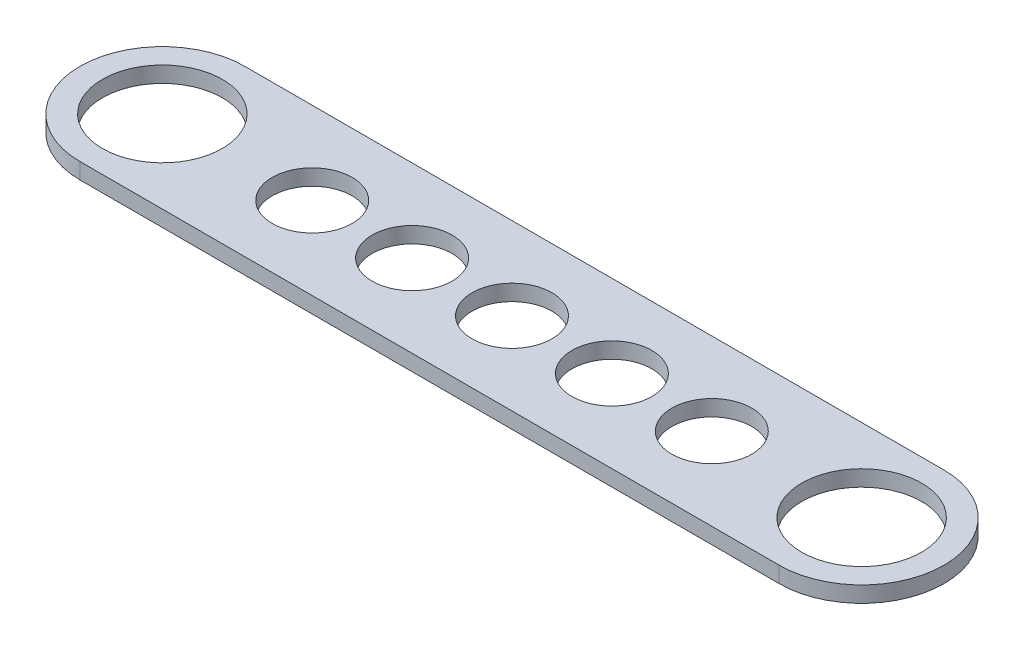
ISO-10303-21;
HEADER;
FILE_DESCRIPTION(('STEP AP214'),'2;1');
FILE_NAME('part.step','',(''),(''),'','','');
FILE_SCHEMA(('AUTOMOTIVE_DESIGN { 1 0 10303 214 1 1 1 1 }'));
ENDSEC;
DATA;
#1=APPLICATION_CONTEXT('core data for automotive mechanical design processes');
#2=APPLICATION_PROTOCOL_DEFINITION('international standard','automotive_design',2000,#1);
#3=PRODUCT_CONTEXT('',#1,'mechanical');
#4=PRODUCT('Part','Part','',(#3));
#5=PRODUCT_RELATED_PRODUCT_CATEGORY('part','',(#4));
#6=PRODUCT_DEFINITION_FORMATION('','',#4);
#7=PRODUCT_DEFINITION_CONTEXT('part definition',#1,'design');
#8=PRODUCT_DEFINITION('design','',#6,#7);
#9=PRODUCT_DEFINITION_SHAPE('','',#8);
#10=(LENGTH_UNIT() NAMED_UNIT(*) SI_UNIT(.MILLI.,.METRE.));
#11=(NAMED_UNIT(*) PLANE_ANGLE_UNIT() SI_UNIT($,.RADIAN.));
#12=(NAMED_UNIT(*) SI_UNIT($,.STERADIAN.) SOLID_ANGLE_UNIT());
#13=UNCERTAINTY_MEASURE_WITH_UNIT(LENGTH_MEASURE(1.E-05),#10,'distance_accuracy_value','');
#14=(GEOMETRIC_REPRESENTATION_CONTEXT(3) GLOBAL_UNCERTAINTY_ASSIGNED_CONTEXT((#13)) GLOBAL_UNIT_ASSIGNED_CONTEXT((#10,
#11,#12)) REPRESENTATION_CONTEXT('',''));
#15=CARTESIAN_POINT('',(0.,0.,0.));
#16=DIRECTION('',(0.,0.,1.));
#17=DIRECTION('',(1.,0.,0.));
#18=AXIS2_PLACEMENT_3D('',#15,#16,#17);
#19=CARTESIAN_POINT('',(0.,4.064,0.));
#20=DIRECTION('',(0.,1.,0.));
#21=DIRECTION('',(0.,0.,1.));
#22=AXIS2_PLACEMENT_3D('',#19,#20,#21);
#23=PLANE('',#22);
#24=CARTESIAN_POINT('',(63.5,4.064,0.));
#25=DIRECTION('',(0.,1.,0.));
#26=DIRECTION('',(0.,0.,1.));
#27=AXIS2_PLACEMENT_3D('',#24,#25,#26);
#28=CIRCLE('',#27,10.16);
#29=CARTESIAN_POINT('',(63.5,4.064,10.16));
#30=VERTEX_POINT('',#29);
#31=EDGE_CURVE('E276',#30,#30,#28,.T.);
#32=ORIENTED_EDGE('',*,*,#31,.F.);
#33=EDGE_LOOP('',(#32));
#34=FACE_BOUND('',#33,.T.);
#35=CARTESIAN_POINT('',(38.1,4.064,0.));
#36=DIRECTION('',(0.,1.,0.));
#37=DIRECTION('',(0.,0.,1.));
#38=AXIS2_PLACEMENT_3D('',#35,#36,#37);
#39=CIRCLE('',#38,10.16);
#40=CARTESIAN_POINT('',(38.1,4.064,10.16));
#41=VERTEX_POINT('',#40);
#42=EDGE_CURVE('E273',#41,#41,#39,.T.);
#43=ORIENTED_EDGE('',*,*,#42,.F.);
#44=EDGE_LOOP('',(#43));
#45=FACE_BOUND('',#44,.T.);
#46=CARTESIAN_POINT('',(0.,4.064,0.));
#47=DIRECTION('',(0.,1.,0.));
#48=DIRECTION('',(0.,0.,1.));
#49=AXIS2_PLACEMENT_3D('',#46,#47,#48);
#50=CIRCLE('',#49,15.24);
#51=CARTESIAN_POINT('',(0.,4.064,15.24));
#52=VERTEX_POINT('',#51);
#53=EDGE_CURVE('E104',#52,#52,#50,.T.);
#54=ORIENTED_EDGE('',*,*,#53,.F.);
#55=EDGE_LOOP('',(#54));
#56=FACE_BOUND('',#55,.T.);
#57=CARTESIAN_POINT('',(0.,4.064,0.));
#58=DIRECTION('',(0.,1.,0.));
#59=DIRECTION('',(0.,0.,1.));
#60=AXIS2_PLACEMENT_3D('',#57,#58,#59);
#61=CIRCLE('',#60,20.955);
#62=CARTESIAN_POINT('',(0.,4.064,-20.955));
#63=VERTEX_POINT('',#62);
#64=CARTESIAN_POINT('',(0.,4.064,20.955));
#65=VERTEX_POINT('',#64);
#66=EDGE_CURVE('E86',#63,#65,#61,.T.);
#67=ORIENTED_EDGE('',*,*,#66,.T.);
#68=DIRECTION('',(1.,0.,0.));
#69=VECTOR('',#68,1.);
#70=CARTESIAN_POINT('',(0.,4.064,20.955));
#71=LINE('',#70,#69);
#72=CARTESIAN_POINT('',(177.8,4.064,20.955));
#73=VERTEX_POINT('',#72);
#74=EDGE_CURVE('E81',#65,#73,#71,.T.);
#75=ORIENTED_EDGE('',*,*,#74,.T.);
#76=CARTESIAN_POINT('',(177.8,4.064,0.));
#77=DIRECTION('',(0.,1.,0.));
#78=DIRECTION('',(0.,0.,1.));
#79=AXIS2_PLACEMENT_3D('',#76,#77,#78);
#80=CIRCLE('',#79,20.955);
#81=CARTESIAN_POINT('',(177.8,4.064,-20.955));
#82=VERTEX_POINT('',#81);
#83=EDGE_CURVE('E84',#73,#82,#80,.T.);
#84=ORIENTED_EDGE('',*,*,#83,.T.);
#85=DIRECTION('',(-1.,0.,0.));
#86=VECTOR('',#85,1.);
#87=CARTESIAN_POINT('',(0.,4.064,-20.955));
#88=LINE('',#87,#86);
#89=EDGE_CURVE('E50',#82,#63,#88,.T.);
#90=ORIENTED_EDGE('',*,*,#89,.T.);
#91=EDGE_LOOP('',(#67,#75,#84,#90));
#92=FACE_BOUND('',#91,.T.);
#93=CARTESIAN_POINT('',(177.8,4.064,0.));
#94=DIRECTION('',(0.,1.,0.));
#95=DIRECTION('',(0.,0.,1.));
#96=AXIS2_PLACEMENT_3D('',#93,#94,#95);
#97=CIRCLE('',#96,15.24);
#98=CARTESIAN_POINT('',(177.8,4.064,15.24));
#99=VERTEX_POINT('',#98);
#100=EDGE_CURVE('E263',#99,#99,#97,.T.);
#101=ORIENTED_EDGE('',*,*,#100,.F.);
#102=EDGE_LOOP('',(#101));
#103=FACE_BOUND('',#102,.T.);
#104=CARTESIAN_POINT('',(88.9,4.064,0.));
#105=DIRECTION('',(0.,1.,0.));
#106=DIRECTION('',(0.,0.,1.));
#107=AXIS2_PLACEMENT_3D('',#104,#105,#106);
#108=CIRCLE('',#107,10.16);
#109=CARTESIAN_POINT('',(88.9,4.064,10.16));
#110=VERTEX_POINT('',#109);
#111=EDGE_CURVE('E114',#110,#110,#108,.T.);
#112=ORIENTED_EDGE('',*,*,#111,.F.);
#113=EDGE_LOOP('',(#112));
#114=FACE_BOUND('',#113,.T.);
#115=CARTESIAN_POINT('',(114.3,4.064,0.));
#116=DIRECTION('',(0.,1.,0.));
#117=DIRECTION('',(0.,0.,1.));
#118=AXIS2_PLACEMENT_3D('',#115,#116,#117);
#119=CIRCLE('',#118,10.16);
#120=CARTESIAN_POINT('',(114.3,4.064,10.16));
#121=VERTEX_POINT('',#120);
#122=EDGE_CURVE('E120',#121,#121,#119,.T.);
#123=ORIENTED_EDGE('',*,*,#122,.F.);
#124=EDGE_LOOP('',(#123));
#125=FACE_BOUND('',#124,.T.);
#126=CARTESIAN_POINT('',(139.7,4.064,0.));
#127=DIRECTION('',(0.,1.,0.));
#128=DIRECTION('',(0.,0.,1.));
#129=AXIS2_PLACEMENT_3D('',#126,#127,#128);
#130=CIRCLE('',#129,10.16);
#131=CARTESIAN_POINT('',(139.7,4.064,10.16));
#132=VERTEX_POINT('',#131);
#133=EDGE_CURVE('E11',#132,#132,#130,.T.);
#134=ORIENTED_EDGE('',*,*,#133,.F.);
#135=EDGE_LOOP('',(#134));
#136=FACE_BOUND('',#135,.T.);
#137=ADVANCED_FACE('F33',(#34,#45,#56,#92,#103,#114,#125,#136),#23,.T.);
#138=CARTESIAN_POINT('',(0.,0.,0.));
#139=DIRECTION('',(0.,1.,0.));
#140=DIRECTION('',(0.,0.,1.));
#141=AXIS2_PLACEMENT_3D('',#138,#139,#140);
#142=PLANE('',#141);
#143=CARTESIAN_POINT('',(63.5,0.,0.));
#144=DIRECTION('',(0.,1.,0.));
#145=DIRECTION('',(0.,0.,1.));
#146=AXIS2_PLACEMENT_3D('',#143,#144,#145);
#147=CIRCLE('',#146,10.16);
#148=CARTESIAN_POINT('',(63.5,0.,10.16));
#149=VERTEX_POINT('',#148);
#150=EDGE_CURVE('E281',#149,#149,#147,.T.);
#151=ORIENTED_EDGE('',*,*,#150,.T.);
#152=EDGE_LOOP('',(#151));
#153=FACE_BOUND('',#152,.T.);
#154=CARTESIAN_POINT('',(38.1,0.,0.));
#155=DIRECTION('',(0.,1.,0.));
#156=DIRECTION('',(0.,0.,1.));
#157=AXIS2_PLACEMENT_3D('',#154,#155,#156);
#158=CIRCLE('',#157,10.16);
#159=CARTESIAN_POINT('',(38.1,0.,10.16));
#160=VERTEX_POINT('',#159);
#161=EDGE_CURVE('E271',#160,#160,#158,.T.);
#162=ORIENTED_EDGE('',*,*,#161,.T.);
#163=EDGE_LOOP('',(#162));
#164=FACE_BOUND('',#163,.T.);
#165=CARTESIAN_POINT('',(0.,0.,0.));
#166=DIRECTION('',(0.,1.,0.));
#167=DIRECTION('',(0.,0.,1.));
#168=AXIS2_PLACEMENT_3D('',#165,#166,#167);
#169=CIRCLE('',#168,20.955);
#170=CARTESIAN_POINT('',(0.,0.,-20.955));
#171=VERTEX_POINT('',#170);
#172=CARTESIAN_POINT('',(0.,0.,20.955));
#173=VERTEX_POINT('',#172);
#174=EDGE_CURVE('E101',#171,#173,#169,.T.);
#175=ORIENTED_EDGE('',*,*,#174,.F.);
#176=DIRECTION('',(-1.,0.,0.));
#177=VECTOR('',#176,1.);
#178=CARTESIAN_POINT('',(0.,0.,-20.955));
#179=LINE('',#178,#177);
#180=CARTESIAN_POINT('',(177.8,0.,-20.955));
#181=VERTEX_POINT('',#180);
#182=EDGE_CURVE('E73',#181,#171,#179,.T.);
#183=ORIENTED_EDGE('',*,*,#182,.F.);
#184=CARTESIAN_POINT('',(177.8,0.,0.));
#185=DIRECTION('',(0.,1.,0.));
#186=DIRECTION('',(0.,0.,1.));
#187=AXIS2_PLACEMENT_3D('',#184,#185,#186);
#188=CIRCLE('',#187,20.955);
#189=CARTESIAN_POINT('',(177.8,0.,20.955));
#190=VERTEX_POINT('',#189);
#191=EDGE_CURVE('E67',#190,#181,#188,.T.);
#192=ORIENTED_EDGE('',*,*,#191,.F.);
#193=DIRECTION('',(1.,0.,0.));
#194=VECTOR('',#193,1.);
#195=CARTESIAN_POINT('',(0.,0.,20.955));
#196=LINE('',#195,#194);
#197=EDGE_CURVE('E91',#173,#190,#196,.T.);
#198=ORIENTED_EDGE('',*,*,#197,.F.);
#199=EDGE_LOOP('',(#175,#183,#192,#198));
#200=FACE_BOUND('',#199,.T.);
#201=CARTESIAN_POINT('',(0.,0.,0.));
#202=DIRECTION('',(0.,1.,0.));
#203=DIRECTION('',(0.,0.,1.));
#204=AXIS2_PLACEMENT_3D('',#201,#202,#203);
#205=CIRCLE('',#204,15.24);
#206=CARTESIAN_POINT('',(0.,0.,15.24));
#207=VERTEX_POINT('',#206);
#208=EDGE_CURVE('E261',#207,#207,#205,.T.);
#209=ORIENTED_EDGE('',*,*,#208,.T.);
#210=EDGE_LOOP('',(#209));
#211=FACE_BOUND('',#210,.T.);
#212=CARTESIAN_POINT('',(177.8,0.,0.));
#213=DIRECTION('',(0.,1.,0.));
#214=DIRECTION('',(0.,0.,1.));
#215=AXIS2_PLACEMENT_3D('',#212,#213,#214);
#216=CIRCLE('',#215,15.24);
#217=CARTESIAN_POINT('',(177.8,0.,15.24));
#218=VERTEX_POINT('',#217);
#219=EDGE_CURVE('E267',#218,#218,#216,.T.);
#220=ORIENTED_EDGE('',*,*,#219,.T.);
#221=EDGE_LOOP('',(#220));
#222=FACE_BOUND('',#221,.T.);
#223=CARTESIAN_POINT('',(88.9,0.,0.));
#224=DIRECTION('',(0.,1.,0.));
#225=DIRECTION('',(0.,0.,1.));
#226=AXIS2_PLACEMENT_3D('',#223,#224,#225);
#227=CIRCLE('',#226,10.16);
#228=CARTESIAN_POINT('',(88.9,0.,10.16));
#229=VERTEX_POINT('',#228);
#230=EDGE_CURVE('E111',#229,#229,#227,.T.);
#231=ORIENTED_EDGE('',*,*,#230,.T.);
#232=EDGE_LOOP('',(#231));
#233=FACE_BOUND('',#232,.T.);
#234=CARTESIAN_POINT('',(114.3,0.,0.));
#235=DIRECTION('',(0.,1.,0.));
#236=DIRECTION('',(0.,0.,1.));
#237=AXIS2_PLACEMENT_3D('',#234,#235,#236);
#238=CIRCLE('',#237,10.16);
#239=CARTESIAN_POINT('',(114.3,0.,10.16));
#240=VERTEX_POINT('',#239);
#241=EDGE_CURVE('E117',#240,#240,#238,.T.);
#242=ORIENTED_EDGE('',*,*,#241,.T.);
#243=EDGE_LOOP('',(#242));
#244=FACE_BOUND('',#243,.T.);
#245=CARTESIAN_POINT('',(139.7,0.,0.));
#246=DIRECTION('',(0.,1.,0.));
#247=DIRECTION('',(0.,0.,1.));
#248=AXIS2_PLACEMENT_3D('',#245,#246,#247);
#249=CIRCLE('',#248,10.16);
#250=CARTESIAN_POINT('',(139.7,0.,10.16));
#251=VERTEX_POINT('',#250);
#252=EDGE_CURVE('E42',#251,#251,#249,.T.);
#253=ORIENTED_EDGE('',*,*,#252,.T.);
#254=EDGE_LOOP('',(#253));
#255=FACE_BOUND('',#254,.T.);
#256=ADVANCED_FACE('F125',(#153,#164,#200,#211,#222,#233,#244,#255),#142,.F.);
#257=CARTESIAN_POINT('',(0.,4.064,0.));
#258=DIRECTION('',(0.,-1.,0.));
#259=DIRECTION('',(0.,0.,-1.));
#260=AXIS2_PLACEMENT_3D('',#257,#258,#259);
#261=CYLINDRICAL_SURFACE('',#260,20.955);
#262=ORIENTED_EDGE('',*,*,#174,.T.);
#263=DIRECTION('',(0.,-1.,0.));
#264=VECTOR('',#263,1.);
#265=CARTESIAN_POINT('',(0.,4.064,20.955));
#266=LINE('',#265,#264);
#267=EDGE_CURVE('E92',#65,#173,#266,.T.);
#268=ORIENTED_EDGE('',*,*,#267,.F.);
#269=ORIENTED_EDGE('',*,*,#66,.F.);
#270=DIRECTION('',(0.,-1.,0.));
#271=VECTOR('',#270,1.);
#272=CARTESIAN_POINT('',(0.,4.064,-20.955));
#273=LINE('',#272,#271);
#274=EDGE_CURVE('E97',#63,#171,#273,.T.);
#275=ORIENTED_EDGE('',*,*,#274,.T.);
#276=EDGE_LOOP('',(#262,#268,#269,#275));
#277=FACE_BOUND('',#276,.T.);
#278=ADVANCED_FACE('F138',(#277),#261,.T.);
#279=CARTESIAN_POINT('',(0.,4.064,20.955));
#280=DIRECTION('',(0.,0.,-1.));
#281=DIRECTION('',(-1.,0.,0.));
#282=AXIS2_PLACEMENT_3D('',#279,#280,#281);
#283=PLANE('',#282);
#284=ORIENTED_EDGE('',*,*,#197,.T.);
#285=DIRECTION('',(0.,-1.,0.));
#286=VECTOR('',#285,1.);
#287=CARTESIAN_POINT('',(177.8,4.064,20.955));
#288=LINE('',#287,#286);
#289=EDGE_CURVE('E89',#73,#190,#288,.T.);
#290=ORIENTED_EDGE('',*,*,#289,.F.);
#291=ORIENTED_EDGE('',*,*,#74,.F.);
#292=ORIENTED_EDGE('',*,*,#267,.T.);
#293=EDGE_LOOP('',(#284,#290,#291,#292));
#294=FACE_BOUND('',#293,.T.);
#295=ADVANCED_FACE('F90',(#294),#283,.F.);
#296=CARTESIAN_POINT('',(177.8,4.064,0.));
#297=DIRECTION('',(0.,-1.,0.));
#298=DIRECTION('',(0.,0.,-1.));
#299=AXIS2_PLACEMENT_3D('',#296,#297,#298);
#300=CYLINDRICAL_SURFACE('',#299,20.955);
#301=ORIENTED_EDGE('',*,*,#191,.T.);
#302=DIRECTION('',(0.,-1.,0.));
#303=VECTOR('',#302,1.);
#304=CARTESIAN_POINT('',(177.8,4.064,-20.955));
#305=LINE('',#304,#303);
#306=EDGE_CURVE('E93',#82,#181,#305,.T.);
#307=ORIENTED_EDGE('',*,*,#306,.F.);
#308=ORIENTED_EDGE('',*,*,#83,.F.);
#309=ORIENTED_EDGE('',*,*,#289,.T.);
#310=EDGE_LOOP('',(#301,#307,#308,#309));
#311=FACE_BOUND('',#310,.T.);
#312=ADVANCED_FACE('F95',(#311),#300,.T.);
#313=CARTESIAN_POINT('',(0.,4.064,-20.955));
#314=DIRECTION('',(0.,0.,1.));
#315=DIRECTION('',(1.,0.,0.));
#316=AXIS2_PLACEMENT_3D('',#313,#314,#315);
#317=PLANE('',#316);
#318=ORIENTED_EDGE('',*,*,#182,.T.);
#319=ORIENTED_EDGE('',*,*,#274,.F.);
#320=ORIENTED_EDGE('',*,*,#89,.F.);
#321=ORIENTED_EDGE('',*,*,#306,.T.);
#322=EDGE_LOOP('',(#318,#319,#320,#321));
#323=FACE_BOUND('',#322,.T.);
#324=ADVANCED_FACE('F147',(#323),#317,.F.);
#325=CARTESIAN_POINT('',(0.,4.064,0.));
#326=DIRECTION('',(0.,-1.,0.));
#327=DIRECTION('',(0.,0.,-1.));
#328=AXIS2_PLACEMENT_3D('',#325,#326,#327);
#329=CYLINDRICAL_SURFACE('',#328,15.24);
#330=ORIENTED_EDGE('',*,*,#53,.T.);
#331=EDGE_LOOP('',(#330));
#332=FACE_BOUND('',#331,.T.);
#333=ORIENTED_EDGE('',*,*,#208,.F.);
#334=EDGE_LOOP('',(#333));
#335=FACE_BOUND('',#334,.T.);
#336=ADVANCED_FACE('F144',(#332,#335),#329,.F.);
#337=CARTESIAN_POINT('',(177.8,4.064,0.));
#338=DIRECTION('',(0.,-1.,0.));
#339=DIRECTION('',(0.,0.,-1.));
#340=AXIS2_PLACEMENT_3D('',#337,#338,#339);
#341=CYLINDRICAL_SURFACE('',#340,15.24);
#342=ORIENTED_EDGE('',*,*,#100,.T.);
#343=EDGE_LOOP('',(#342));
#344=FACE_BOUND('',#343,.T.);
#345=ORIENTED_EDGE('',*,*,#219,.F.);
#346=EDGE_LOOP('',(#345));
#347=FACE_BOUND('',#346,.T.);
#348=ADVANCED_FACE('F202',(#344,#347),#341,.F.);
#349=CARTESIAN_POINT('',(38.1,0.,0.));
#350=DIRECTION('',(0.,1.,0.));
#351=DIRECTION('',(0.,0.,1.));
#352=AXIS2_PLACEMENT_3D('',#349,#350,#351);
#353=CYLINDRICAL_SURFACE('',#352,10.16);
#354=ORIENTED_EDGE('',*,*,#161,.F.);
#355=EDGE_LOOP('',(#354));
#356=FACE_BOUND('',#355,.T.);
#357=ORIENTED_EDGE('',*,*,#42,.T.);
#358=EDGE_LOOP('',(#357));
#359=FACE_BOUND('',#358,.T.);
#360=ADVANCED_FACE('F192',(#356,#359),#353,.F.);
#361=CARTESIAN_POINT('',(63.5,0.,0.));
#362=DIRECTION('',(0.,1.,0.));
#363=DIRECTION('',(0.,0.,1.));
#364=AXIS2_PLACEMENT_3D('',#361,#362,#363);
#365=CYLINDRICAL_SURFACE('',#364,10.16);
#366=ORIENTED_EDGE('',*,*,#150,.F.);
#367=EDGE_LOOP('',(#366));
#368=FACE_BOUND('',#367,.T.);
#369=ORIENTED_EDGE('',*,*,#31,.T.);
#370=EDGE_LOOP('',(#369));
#371=FACE_BOUND('',#370,.T.);
#372=ADVANCED_FACE('F159',(#368,#371),#365,.F.);
#373=CARTESIAN_POINT('',(88.9,0.,0.));
#374=DIRECTION('',(0.,1.,0.));
#375=DIRECTION('',(0.,0.,1.));
#376=AXIS2_PLACEMENT_3D('',#373,#374,#375);
#377=CYLINDRICAL_SURFACE('',#376,10.16);
#378=ORIENTED_EDGE('',*,*,#230,.F.);
#379=EDGE_LOOP('',(#378));
#380=FACE_BOUND('',#379,.T.);
#381=ORIENTED_EDGE('',*,*,#111,.T.);
#382=EDGE_LOOP('',(#381));
#383=FACE_BOUND('',#382,.T.);
#384=ADVANCED_FACE('F157',(#380,#383),#377,.F.);
#385=CARTESIAN_POINT('',(114.3,0.,0.));
#386=DIRECTION('',(0.,1.,0.));
#387=DIRECTION('',(0.,0.,1.));
#388=AXIS2_PLACEMENT_3D('',#385,#386,#387);
#389=CYLINDRICAL_SURFACE('',#388,10.16);
#390=ORIENTED_EDGE('',*,*,#241,.F.);
#391=EDGE_LOOP('',(#390));
#392=FACE_BOUND('',#391,.T.);
#393=ORIENTED_EDGE('',*,*,#122,.T.);
#394=EDGE_LOOP('',(#393));
#395=FACE_BOUND('',#394,.T.);
#396=ADVANCED_FACE('F129',(#392,#395),#389,.F.);
#397=CARTESIAN_POINT('',(139.7,0.,0.));
#398=DIRECTION('',(0.,1.,0.));
#399=DIRECTION('',(0.,0.,1.));
#400=AXIS2_PLACEMENT_3D('',#397,#398,#399);
#401=CYLINDRICAL_SURFACE('',#400,10.16);
#402=ORIENTED_EDGE('',*,*,#252,.F.);
#403=EDGE_LOOP('',(#402));
#404=FACE_BOUND('',#403,.T.);
#405=ORIENTED_EDGE('',*,*,#133,.T.);
#406=EDGE_LOOP('',(#405));
#407=FACE_BOUND('',#406,.T.);
#408=ADVANCED_FACE('F35',(#404,#407),#401,.F.);
#409=CLOSED_SHELL('',(#137,#256,#278,#295,#312,#324,#336,#348,#360,#372,#384,#396,#408));
#410=MANIFOLD_SOLID_BREP('B2',#409);
#411=ADVANCED_BREP_SHAPE_REPRESENTATION('',(#18,#410),#14);
#412=SHAPE_DEFINITION_REPRESENTATION(#9,#411);
ENDSEC;
END-ISO-10303-21;
